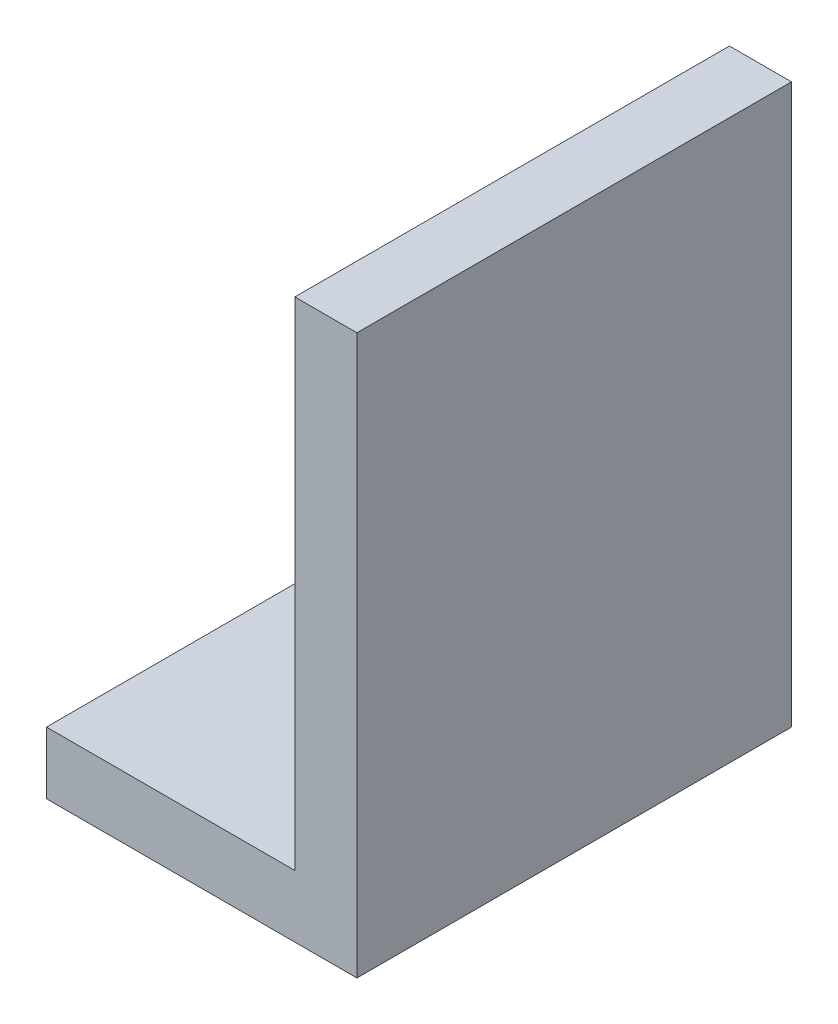
ISO-10303-21;
HEADER;
FILE_DESCRIPTION(('STEP AP214'),'2;1');
FILE_NAME('part.step','',(''),(''),'','','');
FILE_SCHEMA(('AUTOMOTIVE_DESIGN { 1 0 10303 214 1 1 1 1 }'));
ENDSEC;
DATA;
#1=APPLICATION_CONTEXT('core data for automotive mechanical design processes');
#2=APPLICATION_PROTOCOL_DEFINITION('international standard','automotive_design',2000,#1);
#3=PRODUCT_CONTEXT('',#1,'mechanical');
#4=PRODUCT('Part','Part','',(#3));
#5=PRODUCT_RELATED_PRODUCT_CATEGORY('part','',(#4));
#6=PRODUCT_DEFINITION_FORMATION('','',#4);
#7=PRODUCT_DEFINITION_CONTEXT('part definition',#1,'design');
#8=PRODUCT_DEFINITION('design','',#6,#7);
#9=PRODUCT_DEFINITION_SHAPE('','',#8);
#10=(LENGTH_UNIT() NAMED_UNIT(*) SI_UNIT(.MILLI.,.METRE.));
#11=(NAMED_UNIT(*) PLANE_ANGLE_UNIT() SI_UNIT($,.RADIAN.));
#12=(NAMED_UNIT(*) SI_UNIT($,.STERADIAN.) SOLID_ANGLE_UNIT());
#13=UNCERTAINTY_MEASURE_WITH_UNIT(LENGTH_MEASURE(1.E-05),#10,'distance_accuracy_value','');
#14=(GEOMETRIC_REPRESENTATION_CONTEXT(3) GLOBAL_UNCERTAINTY_ASSIGNED_CONTEXT((#13)) GLOBAL_UNIT_ASSIGNED_CONTEXT((#10,
#11,#12)) REPRESENTATION_CONTEXT('',''));
#15=CARTESIAN_POINT('',(0.,0.,0.));
#16=DIRECTION('',(0.,0.,1.));
#17=DIRECTION('',(1.,0.,0.));
#18=AXIS2_PLACEMENT_3D('',#15,#16,#17);
#19=CARTESIAN_POINT('',(0.,0.,70.));
#20=DIRECTION('',(1.,0.,0.));
#21=DIRECTION('',(0.,0.,-1.));
#22=AXIS2_PLACEMENT_3D('',#19,#20,#21);
#23=PLANE('',#22);
#24=DIRECTION('',(0.,-1.,0.));
#25=VECTOR('',#24,1.);
#26=CARTESIAN_POINT('',(0.,0.,0.));
#27=LINE('',#26,#25);
#28=CARTESIAN_POINT('',(0.,10.,0.));
#29=VERTEX_POINT('',#28);
#30=CARTESIAN_POINT('',(0.,0.,0.));
#31=VERTEX_POINT('',#30);
#32=EDGE_CURVE('E117',#29,#31,#27,.T.);
#33=ORIENTED_EDGE('',*,*,#32,.T.);
#34=DIRECTION('',(0.,0.,-1.));
#35=VECTOR('',#34,1.);
#36=CARTESIAN_POINT('',(0.,0.,70.));
#37=LINE('',#36,#35);
#38=CARTESIAN_POINT('',(0.,0.,70.));
#39=VERTEX_POINT('',#38);
#40=EDGE_CURVE('E11',#39,#31,#37,.T.);
#41=ORIENTED_EDGE('',*,*,#40,.F.);
#42=DIRECTION('',(0.,-1.,0.));
#43=VECTOR('',#42,1.);
#44=CARTESIAN_POINT('',(0.,0.,70.));
#45=LINE('',#44,#43);
#46=CARTESIAN_POINT('',(0.,10.,70.));
#47=VERTEX_POINT('',#46);
#48=EDGE_CURVE('E127',#47,#39,#45,.T.);
#49=ORIENTED_EDGE('',*,*,#48,.F.);
#50=DIRECTION('',(0.,0.,-1.));
#51=VECTOR('',#50,1.);
#52=CARTESIAN_POINT('',(0.,10.,70.));
#53=LINE('',#52,#51);
#54=EDGE_CURVE('E113',#47,#29,#53,.T.);
#55=ORIENTED_EDGE('',*,*,#54,.T.);
#56=EDGE_LOOP('',(#33,#41,#49,#55));
#57=FACE_BOUND('',#56,.T.);
#58=ADVANCED_FACE('F33',(#57),#23,.F.);
#59=CARTESIAN_POINT('',(0.,0.,70.));
#60=DIRECTION('',(0.,1.,0.));
#61=DIRECTION('',(0.,0.,1.));
#62=AXIS2_PLACEMENT_3D('',#59,#60,#61);
#63=PLANE('',#62);
#64=DIRECTION('',(1.,0.,0.));
#65=VECTOR('',#64,1.);
#66=CARTESIAN_POINT('',(0.,0.,0.));
#67=LINE('',#66,#65);
#68=CARTESIAN_POINT('',(50.,0.,0.));
#69=VERTEX_POINT('',#68);
#70=EDGE_CURVE('E120',#31,#69,#67,.T.);
#71=ORIENTED_EDGE('',*,*,#70,.T.);
#72=DIRECTION('',(0.,0.,-1.));
#73=VECTOR('',#72,1.);
#74=CARTESIAN_POINT('',(50.,0.,70.));
#75=LINE('',#74,#73);
#76=CARTESIAN_POINT('',(50.,0.,70.));
#77=VERTEX_POINT('',#76);
#78=EDGE_CURVE('E41',#77,#69,#75,.T.);
#79=ORIENTED_EDGE('',*,*,#78,.F.);
#80=DIRECTION('',(1.,0.,0.));
#81=VECTOR('',#80,1.);
#82=CARTESIAN_POINT('',(0.,0.,70.));
#83=LINE('',#82,#81);
#84=EDGE_CURVE('E86',#39,#77,#83,.T.);
#85=ORIENTED_EDGE('',*,*,#84,.F.);
#86=ORIENTED_EDGE('',*,*,#40,.T.);
#87=EDGE_LOOP('',(#71,#79,#85,#86));
#88=FACE_BOUND('',#87,.T.);
#89=ADVANCED_FACE('F151',(#88),#63,.F.);
#90=CARTESIAN_POINT('',(50.,0.,70.));
#91=DIRECTION('',(-1.,0.,0.));
#92=DIRECTION('',(0.,0.,1.));
#93=AXIS2_PLACEMENT_3D('',#90,#91,#92);
#94=PLANE('',#93);
#95=DIRECTION('',(0.,1.,0.));
#96=VECTOR('',#95,1.);
#97=CARTESIAN_POINT('',(50.,0.,0.));
#98=LINE('',#97,#96);
#99=CARTESIAN_POINT('',(50.,90.,0.));
#100=VERTEX_POINT('',#99);
#101=EDGE_CURVE('E122',#69,#100,#98,.T.);
#102=ORIENTED_EDGE('',*,*,#101,.T.);
#103=DIRECTION('',(0.,0.,-1.));
#104=VECTOR('',#103,1.);
#105=CARTESIAN_POINT('',(50.,90.,70.));
#106=LINE('',#105,#104);
#107=CARTESIAN_POINT('',(50.,90.,70.));
#108=VERTEX_POINT('',#107);
#109=EDGE_CURVE('E108',#108,#100,#106,.T.);
#110=ORIENTED_EDGE('',*,*,#109,.F.);
#111=DIRECTION('',(0.,1.,0.));
#112=VECTOR('',#111,1.);
#113=CARTESIAN_POINT('',(50.,0.,70.));
#114=LINE('',#113,#112);
#115=EDGE_CURVE('E99',#77,#108,#114,.T.);
#116=ORIENTED_EDGE('',*,*,#115,.F.);
#117=ORIENTED_EDGE('',*,*,#78,.T.);
#118=EDGE_LOOP('',(#102,#110,#116,#117));
#119=FACE_BOUND('',#118,.T.);
#120=ADVANCED_FACE('F133',(#119),#94,.F.);
#121=CARTESIAN_POINT('',(50.,90.,70.));
#122=DIRECTION('',(0.,-1.,0.));
#123=DIRECTION('',(0.,0.,-1.));
#124=AXIS2_PLACEMENT_3D('',#121,#122,#123);
#125=PLANE('',#124);
#126=DIRECTION('',(-1.,0.,0.));
#127=VECTOR('',#126,1.);
#128=CARTESIAN_POINT('',(50.,90.,0.));
#129=LINE('',#128,#127);
#130=CARTESIAN_POINT('',(40.,90.,0.));
#131=VERTEX_POINT('',#130);
#132=EDGE_CURVE('E107',#100,#131,#129,.T.);
#133=ORIENTED_EDGE('',*,*,#132,.T.);
#134=DIRECTION('',(0.,0.,-1.));
#135=VECTOR('',#134,1.);
#136=CARTESIAN_POINT('',(40.,90.,70.));
#137=LINE('',#136,#135);
#138=CARTESIAN_POINT('',(40.,90.,70.));
#139=VERTEX_POINT('',#138);
#140=EDGE_CURVE('E104',#139,#131,#137,.T.);
#141=ORIENTED_EDGE('',*,*,#140,.F.);
#142=DIRECTION('',(-1.,0.,0.));
#143=VECTOR('',#142,1.);
#144=CARTESIAN_POINT('',(50.,90.,70.));
#145=LINE('',#144,#143);
#146=EDGE_CURVE('E93',#108,#139,#145,.T.);
#147=ORIENTED_EDGE('',*,*,#146,.F.);
#148=ORIENTED_EDGE('',*,*,#109,.T.);
#149=EDGE_LOOP('',(#133,#141,#147,#148));
#150=FACE_BOUND('',#149,.T.);
#151=ADVANCED_FACE('F105',(#150),#125,.F.);
#152=CARTESIAN_POINT('',(40.,90.,70.));
#153=DIRECTION('',(1.,0.,0.));
#154=DIRECTION('',(0.,1.,0.));
#155=AXIS2_PLACEMENT_3D('',#152,#153,#154);
#156=PLANE('',#155);
#157=DIRECTION('',(0.,-1.,0.));
#158=VECTOR('',#157,1.);
#159=CARTESIAN_POINT('',(40.,90.,0.));
#160=LINE('',#159,#158);
#161=CARTESIAN_POINT('',(40.,10.,0.));
#162=VERTEX_POINT('',#161);
#163=EDGE_CURVE('E72',#131,#162,#160,.T.);
#164=ORIENTED_EDGE('',*,*,#163,.T.);
#165=DIRECTION('',(0.,0.,-1.));
#166=VECTOR('',#165,1.);
#167=CARTESIAN_POINT('',(40.,10.,70.));
#168=LINE('',#167,#166);
#169=CARTESIAN_POINT('',(40.,10.,70.));
#170=VERTEX_POINT('',#169);
#171=EDGE_CURVE('E109',#170,#162,#168,.T.);
#172=ORIENTED_EDGE('',*,*,#171,.F.);
#173=DIRECTION('',(0.,-1.,0.));
#174=VECTOR('',#173,1.);
#175=CARTESIAN_POINT('',(40.,90.,70.));
#176=LINE('',#175,#174);
#177=EDGE_CURVE('E97',#139,#170,#176,.T.);
#178=ORIENTED_EDGE('',*,*,#177,.F.);
#179=ORIENTED_EDGE('',*,*,#140,.T.);
#180=EDGE_LOOP('',(#164,#172,#178,#179));
#181=FACE_BOUND('',#180,.T.);
#182=ADVANCED_FACE('F111',(#181),#156,.F.);
#183=CARTESIAN_POINT('',(0.,10.,70.));
#184=DIRECTION('',(0.,-1.,0.));
#185=DIRECTION('',(0.,0.,-1.));
#186=AXIS2_PLACEMENT_3D('',#183,#184,#185);
#187=PLANE('',#186);
#188=DIRECTION('',(-1.,0.,0.));
#189=VECTOR('',#188,1.);
#190=CARTESIAN_POINT('',(0.,10.,0.));
#191=LINE('',#190,#189);
#192=EDGE_CURVE('E78',#162,#29,#191,.T.);
#193=ORIENTED_EDGE('',*,*,#192,.T.);
#194=ORIENTED_EDGE('',*,*,#54,.F.);
#195=DIRECTION('',(-1.,0.,0.));
#196=VECTOR('',#195,1.);
#197=CARTESIAN_POINT('',(0.,10.,70.));
#198=LINE('',#197,#196);
#199=EDGE_CURVE('E49',#170,#47,#198,.T.);
#200=ORIENTED_EDGE('',*,*,#199,.F.);
#201=ORIENTED_EDGE('',*,*,#171,.T.);
#202=EDGE_LOOP('',(#193,#194,#200,#201));
#203=FACE_BOUND('',#202,.T.);
#204=ADVANCED_FACE('F140',(#203),#187,.F.);
#205=CARTESIAN_POINT('',(0.,0.,70.));
#206=DIRECTION('',(0.,0.,-1.));
#207=DIRECTION('',(-1.,0.,0.));
#208=AXIS2_PLACEMENT_3D('',#205,#206,#207);
#209=PLANE('',#208);
#210=ORIENTED_EDGE('',*,*,#48,.T.);
#211=ORIENTED_EDGE('',*,*,#84,.T.);
#212=ORIENTED_EDGE('',*,*,#115,.T.);
#213=ORIENTED_EDGE('',*,*,#146,.T.);
#214=ORIENTED_EDGE('',*,*,#177,.T.);
#215=ORIENTED_EDGE('',*,*,#199,.T.);
#216=EDGE_LOOP('',(#210,#211,#212,#213,#214,#215));
#217=FACE_BOUND('',#216,.T.);
#218=ADVANCED_FACE('F95',(#217),#209,.F.);
#219=CARTESIAN_POINT('',(0.,0.,0.));
#220=DIRECTION('',(0.,0.,-1.));
#221=DIRECTION('',(-1.,0.,0.));
#222=AXIS2_PLACEMENT_3D('',#219,#220,#221);
#223=PLANE('',#222);
#224=ORIENTED_EDGE('',*,*,#32,.F.);
#225=ORIENTED_EDGE('',*,*,#192,.F.);
#226=ORIENTED_EDGE('',*,*,#163,.F.);
#227=ORIENTED_EDGE('',*,*,#132,.F.);
#228=ORIENTED_EDGE('',*,*,#101,.F.);
#229=ORIENTED_EDGE('',*,*,#70,.F.);
#230=EDGE_LOOP('',(#224,#225,#226,#227,#228,#229));
#231=FACE_BOUND('',#230,.T.);
#232=ADVANCED_FACE('F136',(#231),#223,.T.);
#233=CLOSED_SHELL('',(#58,#89,#120,#151,#182,#204,#218,#232));
#234=MANIFOLD_SOLID_BREP('B2',#233);
#235=ADVANCED_BREP_SHAPE_REPRESENTATION('',(#18,#234),#14);
#236=SHAPE_DEFINITION_REPRESENTATION(#9,#235);
ENDSEC;
END-ISO-10303-21;
